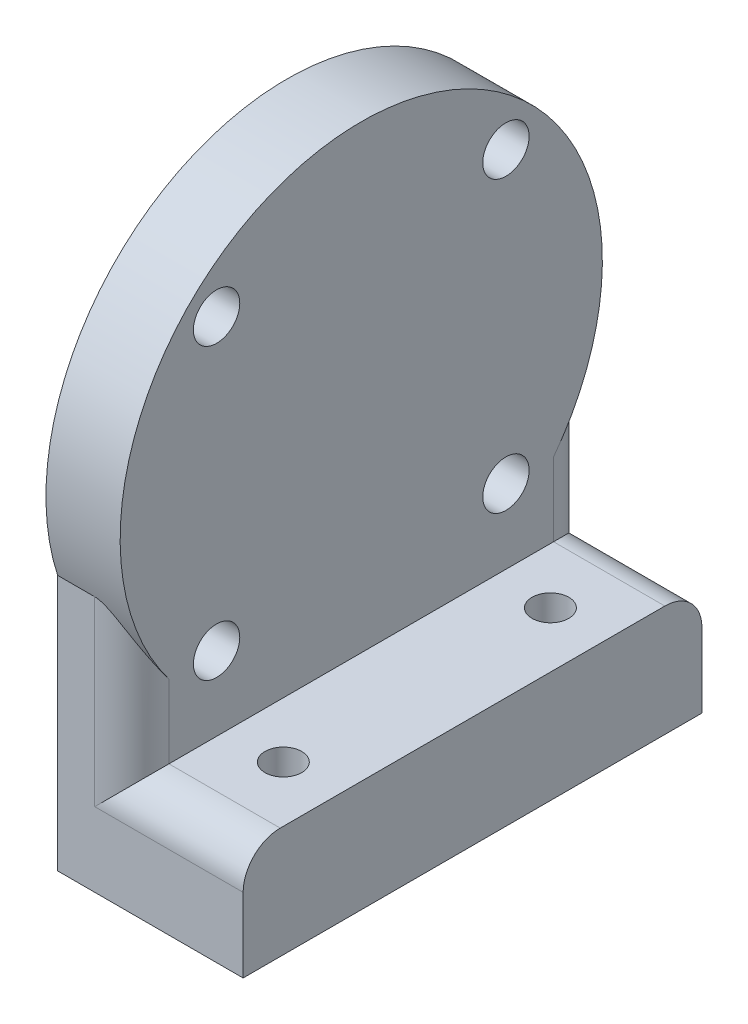
ISO-10303-21;
HEADER;
FILE_DESCRIPTION(('STEP AP214'),'2;1');
FILE_NAME('part.step','',(''),(''),'','','');
FILE_SCHEMA(('AUTOMOTIVE_DESIGN { 1 0 10303 214 1 1 1 1 }'));
ENDSEC;
DATA;
#1=APPLICATION_CONTEXT('core data for automotive mechanical design processes');
#2=APPLICATION_PROTOCOL_DEFINITION('international standard','automotive_design',2000,#1);
#3=PRODUCT_CONTEXT('',#1,'mechanical');
#4=PRODUCT('Part','Part','',(#3));
#5=PRODUCT_RELATED_PRODUCT_CATEGORY('part','',(#4));
#6=PRODUCT_DEFINITION_FORMATION('','',#4);
#7=PRODUCT_DEFINITION_CONTEXT('part definition',#1,'design');
#8=PRODUCT_DEFINITION('design','',#6,#7);
#9=PRODUCT_DEFINITION_SHAPE('','',#8);
#10=(LENGTH_UNIT() NAMED_UNIT(*) SI_UNIT(.MILLI.,.METRE.));
#11=(NAMED_UNIT(*) PLANE_ANGLE_UNIT() SI_UNIT($,.RADIAN.));
#12=(NAMED_UNIT(*) SI_UNIT($,.STERADIAN.) SOLID_ANGLE_UNIT());
#13=UNCERTAINTY_MEASURE_WITH_UNIT(LENGTH_MEASURE(1.E-05),#10,'distance_accuracy_value','');
#14=(GEOMETRIC_REPRESENTATION_CONTEXT(3) GLOBAL_UNCERTAINTY_ASSIGNED_CONTEXT((#13)) GLOBAL_UNIT_ASSIGNED_CONTEXT((#10,
#11,#12)) REPRESENTATION_CONTEXT('',''));
#15=CARTESIAN_POINT('',(0.,0.,0.));
#16=DIRECTION('',(0.,0.,1.));
#17=DIRECTION('',(1.,0.,0.));
#18=AXIS2_PLACEMENT_3D('',#15,#16,#17);
#19=CARTESIAN_POINT('',(10.,0.,0.));
#20=DIRECTION('',(-1.,0.,0.));
#21=DIRECTION('',(0.,0.,1.));
#22=AXIS2_PLACEMENT_3D('',#19,#20,#21);
#23=CYLINDRICAL_SURFACE('',#22,32.5);
#24=CARTESIAN_POINT('',(10.,0.,0.));
#25=DIRECTION('',(1.,0.,0.));
#26=DIRECTION('',(0.,0.,-1.));
#27=AXIS2_PLACEMENT_3D('',#24,#25,#26);
#28=CIRCLE('',#27,32.5);
#29=CARTESIAN_POINT('',(10.,-19.6018601648243,-25.9232921921324));
#30=VERTEX_POINT('',#29);
#31=CARTESIAN_POINT('',(10.,-19.6018601648243,25.9232921921325));
#32=VERTEX_POINT('',#31);
#33=EDGE_CURVE('E131',#30,#32,#28,.T.);
#34=ORIENTED_EDGE('',*,*,#33,.F.);
#35=CARTESIAN_POINT('',(10.,-19.6018601648243,-25.9232921921325));
#36=CARTESIAN_POINT('',(9.99998785813294,-19.4446933962099,-26.0421383240384));
#37=CARTESIAN_POINT('',(9.99576308085677,-19.2864612415139,-26.1595341988052));
#38=CARTESIAN_POINT('',(9.97941358114551,-18.9681930478085,-26.3912167495624));
#39=CARTESIAN_POINT('',(9.96729073501091,-18.8081574461053,-26.5055041572981));
#40=CARTESIAN_POINT('',(9.93568153678088,-18.4866524819665,-26.7307349325186));
#41=CARTESIAN_POINT('',(9.91620060162878,-18.3251842593972,-26.8416806953652));
#42=CARTESIAN_POINT('',(9.87030994286588,-18.0009507578986,-27.0601923213267));
#43=CARTESIAN_POINT('',(9.84389973226215,-17.8381853885849,-27.1677579462888));
#44=CARTESIAN_POINT('',(9.75363592974372,-17.3415549424522,-27.4896001103524));
#45=CARTESIAN_POINT('',(9.6794237483802,-17.0059581978761,-27.6983977111794));
#46=CARTESIAN_POINT('',(9.50620989951119,-16.3322431150558,-28.1009242670519));
#47=CARTESIAN_POINT('',(9.40720706410947,-15.9941246587413,-28.2946525116112));
#48=CARTESIAN_POINT('',(9.17820527903657,-15.2941817824925,-28.6793989589671));
#49=CARTESIAN_POINT('',(9.04656244862404,-14.9323011639338,-28.8693470905034));
#50=CARTESIAN_POINT('',(8.82882960544987,-14.3907709578673,-29.1409788427625));
#51=CARTESIAN_POINT('',(8.75281545727215,-14.2103541113143,-29.229363099304));
#52=CARTESIAN_POINT('',(8.59375465446422,-13.8504582275516,-29.4016083312248));
#53=CARTESIAN_POINT('',(8.51070843259636,-13.6709791333522,-29.4854695844359));
#54=CARTESIAN_POINT('',(8.33798578145804,-13.3153065603456,-29.6477730810611));
#55=CARTESIAN_POINT('',(8.24838277688641,-13.1390981335559,-29.7262605925395));
#56=CARTESIAN_POINT('',(8.06110896617103,-12.7889698600797,-29.8785654715547));
#57=CARTESIAN_POINT('',(7.96343907795765,-12.6150497556089,-29.9523833687633));
#58=CARTESIAN_POINT('',(7.75909766661963,-12.2710033039346,-30.0949676409248));
#59=CARTESIAN_POINT('',(7.65244591686164,-12.1008696143258,-30.1637445195341));
#60=CARTESIAN_POINT('',(7.4282624495199,-11.7658471830656,-30.2959927394941));
#61=CARTESIAN_POINT('',(7.31073828529234,-11.6009549054901,-30.3594677067479));
#62=CARTESIAN_POINT('',(7.13598011446697,-11.3750335950163,-30.4444327188526));
#63=CARTESIAN_POINT('',(7.08444257619157,-11.3105385350068,-30.4684478265857));
#64=CARTESIAN_POINT('',(6.97885607849103,-11.1832420527845,-30.5154011408752));
#65=CARTESIAN_POINT('',(6.924807048535,-11.1204406782143,-30.5383393171514));
#66=CARTESIAN_POINT('',(6.75815611719442,-10.9347584590993,-30.6055275028806));
#67=CARTESIAN_POINT('',(6.64129657707948,-10.8149249091174,-30.6480291961218));
#68=CARTESIAN_POINT('',(6.45449376777346,-10.6443609124064,-30.7075122948644));
#69=CARTESIAN_POINT('',(6.38980937194668,-10.5886780085011,-30.72674856593));
#70=CARTESIAN_POINT('',(6.2563574555159,-10.48179902235,-30.7633725732251));
#71=CARTESIAN_POINT('',(6.18758841043837,-10.4306046331843,-30.7807596124417));
#72=CARTESIAN_POINT('',(5.97496951243204,-10.2861458006791,-30.8294558506852));
#73=CARTESIAN_POINT('',(5.82403814428358,-10.2012599197118,-30.8575580291418));
#74=CARTESIAN_POINT('',(5.5769578747899,-10.1003891744018,-30.8906719294122));
#75=CARTESIAN_POINT('',(5.48708593341021,-10.0706234612454,-30.9003732593906));
#76=CARTESIAN_POINT('',(5.30345832023253,-10.0258996193538,-30.9149141691966));
#77=CARTESIAN_POINT('',(5.20971631829817,-10.0108933584484,-30.919769552948));
#78=CARTESIAN_POINT('',(5.07700342923393,-10.0013593117558,-30.9228521641555));
#79=CARTESIAN_POINT('',(5.03849639769414,-9.99996573509313,-30.9233021704094));
#80=CARTESIAN_POINT('',(5.,-10.0000000000001,-30.9232921921324));
#81=B_SPLINE_CURVE_WITH_KNOTS('',3,(#35,#36,#37,#38,#39,#40,#41,#42,#43,#44,#45,#46,#47,#48,#49,
#50,#51,#52,#53,#54,#55,#56,#57,#58,#59,#60,#61,#62,#63,#64,#65,#66,#67,#68,#69,#70,#71,#72,#73,
#74,#75,#76,#77,#78,#79,#80),.UNSPECIFIED.,.F.,.F.,(4,2,2,2,2,2,2,2,2,2,2,2,2,2,2,2,2,2,2,2,2,2,
4),(0.,0.591038002917525,1.18193564738411,1.7723991247862,2.36290411137619,3.56811560129786,
4.77338387983301,6.06019419424251,6.70447369130864,7.34871356740912,7.9866030201678,
8.6244199872493,9.26086778901706,9.89687670721251,10.1547593329167,10.4126492051889,
10.9297035978319,11.1919561813796,11.4543072655177,11.9757309886765,12.2601824310296,
12.5437031399848,12.6592024651113),.UNSPECIFIED.);
#82=CARTESIAN_POINT('',(5.,-10.,-30.9232921921325));
#83=VERTEX_POINT('',#82);
#84=EDGE_CURVE('E42',#30,#83,#81,.T.);
#85=ORIENTED_EDGE('',*,*,#84,.T.);
#86=DIRECTION('',(-1.,0.,0.));
#87=VECTOR('',#86,1.);
#88=CARTESIAN_POINT('',(80.8184298046773,-10.,-30.9232921921325));
#89=LINE('',#88,#87);
#90=CARTESIAN_POINT('',(0.,-10.,-30.9232921921325));
#91=VERTEX_POINT('',#90);
#92=EDGE_CURVE('E118',#83,#91,#89,.T.);
#93=ORIENTED_EDGE('',*,*,#92,.T.);
#94=CARTESIAN_POINT('',(0.,0.,0.));
#95=DIRECTION('',(1.,0.,0.));
#96=DIRECTION('',(0.,0.,-1.));
#97=AXIS2_PLACEMENT_3D('',#94,#95,#96);
#98=CIRCLE('',#97,32.5);
#99=CARTESIAN_POINT('',(0.,-10.,30.9232921921325));
#100=VERTEX_POINT('',#99);
#101=EDGE_CURVE('E125',#91,#100,#98,.T.);
#102=ORIENTED_EDGE('',*,*,#101,.T.);
#103=DIRECTION('',(-1.,0.,0.));
#104=VECTOR('',#103,1.);
#105=CARTESIAN_POINT('',(80.8184298046773,-10.,30.9232921921325));
#106=LINE('',#105,#104);
#107=CARTESIAN_POINT('',(5.,-10.,30.9232921921325));
#108=VERTEX_POINT('',#107);
#109=EDGE_CURVE('E109',#108,#100,#106,.T.);
#110=ORIENTED_EDGE('',*,*,#109,.F.);
#111=CARTESIAN_POINT('',(5.,-10.,30.9232921921325));
#112=CARTESIAN_POINT('',(5.05243279865254,-9.99996472826525,30.9233022453066));
#113=CARTESIAN_POINT('',(5.10484230577684,-10.0025492211647,30.9224678090984));
#114=CARTESIAN_POINT('',(5.20903070353185,-10.0126803462576,30.9191895538381));
#115=CARTESIAN_POINT('',(5.26081061215415,-10.0202174368638,30.9167488294185));
#116=CARTESIAN_POINT('',(5.36252242651876,-10.0398167285245,30.9103894659815));
#117=CARTESIAN_POINT('',(5.41247070564672,-10.0518029145889,30.9064956480947));
#118=CARTESIAN_POINT('',(5.51108096078863,-10.0798800839116,30.8973500224581));
#119=CARTESIAN_POINT('',(5.55974225686286,-10.0959731909494,30.8920975120792));
#120=CARTESIAN_POINT('',(5.73183208206213,-10.160326014987,30.8710243146895));
#121=CARTESIAN_POINT('',(5.85099118265557,-10.219015053902,30.8516889751184));
#122=CARTESIAN_POINT('',(6.0788056190665,-10.3531885937044,30.8069230519787));
#123=CARTESIAN_POINT('',(6.18737614038127,-10.428794895745,30.7814481566773));
#124=CARTESIAN_POINT('',(6.3903826324603,-10.5875817273045,30.7271847661825));
#125=CARTESIAN_POINT('',(6.48521548851953,-10.6703249461695,30.6985748236749));
#126=CARTESIAN_POINT('',(6.66728360567938,-10.8427584009582,30.6380964662237));
#127=CARTESIAN_POINT('',(6.75451129052188,-10.9324553999526,30.6062248691886));
#128=CARTESIAN_POINT('',(6.92267021031267,-11.1168509081429,30.5397324083395));
#129=CARTESIAN_POINT('',(7.00359052583381,-11.2115576345868,30.5051069775538));
#130=CARTESIAN_POINT('',(7.15992603416836,-11.4044647879071,30.4335140258417));
#131=CARTESIAN_POINT('',(7.23534321064783,-11.5026639367271,30.3965473579047));
#132=CARTESIAN_POINT('',(7.41466068213455,-11.7468603160495,30.3032215255993));
#133=CARTESIAN_POINT('',(7.51594931294703,-11.8943192044044,30.2456769918685));
#134=CARTESIAN_POINT('',(7.71032924991943,-12.192985353848,30.1265166004586));
#135=CARTESIAN_POINT('',(7.80341722942097,-12.3441941045134,30.0648991081312));
#136=CARTESIAN_POINT('',(7.9826142844992,-12.6493812203704,29.9377774366107));
#137=CARTESIAN_POINT('',(8.06871394684459,-12.8033629907389,29.8722682143145));
#138=CARTESIAN_POINT('',(8.23458870960407,-13.1131404133422,29.7375871060325));
#139=CARTESIAN_POINT('',(8.31436287164873,-13.2689363307835,29.6684146791502));
#140=CARTESIAN_POINT('',(8.46834722660006,-13.5822678156436,29.5262880921394));
#141=CARTESIAN_POINT('',(8.5425387821932,-13.7398073565132,29.4533225301474));
#142=CARTESIAN_POINT('',(8.68541911572378,-14.0557194131722,29.303878659147));
#143=CARTESIAN_POINT('',(8.75410743703855,-14.2140919969227,29.2274000594761));
#144=CARTESIAN_POINT('',(8.95216309243327,-14.6897304869866,28.9928725265024));
#145=CARTESIAN_POINT('',(9.07363934576333,-15.007760416927,28.8296218477662));
#146=CARTESIAN_POINT('',(9.31238922513554,-15.6905952936429,28.464477313778));
#147=CARTESIAN_POINT('',(9.42640615934749,-16.0553875370973,28.2604338745715));
#148=CARTESIAN_POINT('',(9.62617925371721,-16.7825330663001,27.834761734846));
#149=CARTESIAN_POINT('',(9.71193734421034,-17.1448865169831,27.6131342367616));
#150=CARTESIAN_POINT('',(9.81685888815131,-17.6826239835708,27.2693862990727));
#151=CARTESIAN_POINT('',(9.84776496938505,-17.8598648254158,27.1536419796727));
#152=CARTESIAN_POINT('',(9.9015191933038,-18.2128882147727,26.9181296586314));
#153=CARTESIAN_POINT('',(9.92436800023443,-18.38867088133,26.798361989569));
#154=CARTESIAN_POINT('',(9.96148471900396,-18.7386122045262,26.5548464487188));
#155=CARTESIAN_POINT('',(9.97574524317821,-18.912769336475,26.4310952463917));
#156=CARTESIAN_POINT('',(9.9949957753718,-19.258989986863,26.1798997091904));
#157=CARTESIAN_POINT('',(9.99998311066371,-19.4310528875095,26.0524543203198));
#158=CARTESIAN_POINT('',(10.,-19.6018601648243,25.9232921921325));
#159=B_SPLINE_CURVE_WITH_KNOTS('',3,(#111,#112,#113,#114,#115,#116,#117,#118,#119,#120,#121,
#122,#123,#124,#125,#126,#127,#128,#129,#130,#131,#132,#133,#134,#135,#136,#137,#138,#139,#140,
#141,#142,#143,#144,#145,#146,#147,#148,#149,#150,#151,#152,#153,#154,#155,#156,#157,#158),
.UNSPECIFIED.,.F.,.F.,(4,2,2,2,2,2,2,2,2,2,2,2,2,2,2,2,2,2,2,2,2,2,2,4),(0.,0.157190726868303,
0.31407949729913,0.468402656279282,0.622805781458559,1.02295811687609,1.42608988692812,
1.81270282228678,2.19969660207382,2.58734612129456,2.97485521062451,3.53827708275912,
4.10192646894037,4.6663229055475,5.23080291267597,5.79709071702267,6.36342545969977,
7.49522074332626,8.79378435174101,10.0922592380849,10.7338924227701,11.3754726985293,
12.0176040780555,12.659920504634),.UNSPECIFIED.);
#160=EDGE_CURVE('E11',#108,#32,#159,.T.);
#161=ORIENTED_EDGE('',*,*,#160,.T.);
#162=EDGE_LOOP('',(#34,#85,#93,#102,#110,#161));
#163=FACE_BOUND('',#162,.T.);
#164=ADVANCED_FACE('F33',(#163),#23,.T.);
#165=CARTESIAN_POINT('',(10.,0.,0.));
#166=DIRECTION('',(1.,0.,0.));
#167=DIRECTION('',(0.,0.,-1.));
#168=AXIS2_PLACEMENT_3D('',#165,#166,#167);
#169=PLANE('',#168);
#170=DIRECTION('',(0.,0.,1.));
#171=VECTOR('',#170,1.);
#172=CARTESIAN_POINT('',(10.,-29.5,30.9232921921325));
#173=LINE('',#172,#171);
#174=CARTESIAN_POINT('',(10.,-29.5,-25.9232921921325));
#175=VERTEX_POINT('',#174);
#176=CARTESIAN_POINT('',(10.,-29.5,25.9232921921325));
#177=VERTEX_POINT('',#176);
#178=EDGE_CURVE('E134',#175,#177,#173,.T.);
#179=ORIENTED_EDGE('',*,*,#178,.F.);
#180=DIRECTION('',(0.,-1.,0.));
#181=VECTOR('',#180,1.);
#182=CARTESIAN_POINT('',(10.,-10.,-25.9232921921324));
#183=LINE('',#182,#181);
#184=EDGE_CURVE('E148',#175,#30,#183,.F.);
#185=ORIENTED_EDGE('',*,*,#184,.T.);
#186=ORIENTED_EDGE('',*,*,#33,.T.);
#187=DIRECTION('',(0.,1.,0.));
#188=VECTOR('',#187,1.);
#189=CARTESIAN_POINT('',(10.,-29.5,25.9232921921325));
#190=LINE('',#189,#188);
#191=EDGE_CURVE('E146',#32,#177,#190,.F.);
#192=ORIENTED_EDGE('',*,*,#191,.T.);
#193=EDGE_LOOP('',(#179,#185,#186,#192));
#194=FACE_BOUND('',#193,.T.);
#195=CARTESIAN_POINT('',(10.,-19.502005025125,-19.502005025125));
#196=DIRECTION('',(1.,0.,0.));
#197=DIRECTION('',(0.,0.,-1.));
#198=AXIS2_PLACEMENT_3D('',#195,#196,#197);
#199=CIRCLE('',#198,3.125);
#200=CARTESIAN_POINT('',(10.,-19.502005025125,-22.6270050251249));
#201=VERTEX_POINT('',#200);
#202=EDGE_CURVE('E279',#201,#201,#199,.T.);
#203=ORIENTED_EDGE('',*,*,#202,.F.);
#204=EDGE_LOOP('',(#203));
#205=FACE_BOUND('',#204,.T.);
#206=CARTESIAN_POINT('',(10.,19.502005025125,-19.502005025125));
#207=DIRECTION('',(1.,0.,0.));
#208=DIRECTION('',(0.,0.,-1.));
#209=AXIS2_PLACEMENT_3D('',#206,#207,#208);
#210=CIRCLE('',#209,3.125);
#211=CARTESIAN_POINT('',(10.,19.502005025125,-22.627005025125));
#212=VERTEX_POINT('',#211);
#213=EDGE_CURVE('E289',#212,#212,#210,.T.);
#214=ORIENTED_EDGE('',*,*,#213,.F.);
#215=EDGE_LOOP('',(#214));
#216=FACE_BOUND('',#215,.T.);
#217=CARTESIAN_POINT('',(10.,19.502005025125,19.5020050251249));
#218=DIRECTION('',(1.,0.,0.));
#219=DIRECTION('',(0.,0.,-1.));
#220=AXIS2_PLACEMENT_3D('',#217,#218,#219);
#221=CIRCLE('',#220,3.125);
#222=CARTESIAN_POINT('',(10.,19.502005025125,16.3770050251249));
#223=VERTEX_POINT('',#222);
#224=EDGE_CURVE('E283',#223,#223,#221,.T.);
#225=ORIENTED_EDGE('',*,*,#224,.F.);
#226=EDGE_LOOP('',(#225));
#227=FACE_BOUND('',#226,.T.);
#228=CARTESIAN_POINT('',(10.,-19.5020050251249,19.502005025125));
#229=DIRECTION('',(1.,0.,0.));
#230=DIRECTION('',(0.,0.,-1.));
#231=AXIS2_PLACEMENT_3D('',#228,#229,#230);
#232=CIRCLE('',#231,3.125);
#233=CARTESIAN_POINT('',(10.,-19.5020050251249,16.377005025125));
#234=VERTEX_POINT('',#233);
#235=EDGE_CURVE('E137',#234,#234,#232,.T.);
#236=ORIENTED_EDGE('',*,*,#235,.F.);
#237=EDGE_LOOP('',(#236));
#238=FACE_BOUND('',#237,.T.);
#239=ADVANCED_FACE('F191',(#194,#205,#216,#227,#238),#169,.T.);
#240=CARTESIAN_POINT('',(0.,0.,0.));
#241=DIRECTION('',(1.,0.,0.));
#242=DIRECTION('',(0.,0.,-1.));
#243=AXIS2_PLACEMENT_3D('',#240,#241,#242);
#244=PLANE('',#243);
#245=CARTESIAN_POINT('',(0.,-19.502005025125,-19.502005025125));
#246=DIRECTION('',(1.,0.,0.));
#247=DIRECTION('',(0.,0.,-1.));
#248=AXIS2_PLACEMENT_3D('',#245,#246,#247);
#249=CIRCLE('',#248,3.125);
#250=CARTESIAN_POINT('',(0.,-19.502005025125,-22.6270050251249));
#251=VERTEX_POINT('',#250);
#252=EDGE_CURVE('E292',#251,#251,#249,.T.);
#253=ORIENTED_EDGE('',*,*,#252,.T.);
#254=EDGE_LOOP('',(#253));
#255=FACE_BOUND('',#254,.T.);
#256=CARTESIAN_POINT('',(0.,19.502005025125,-19.502005025125));
#257=DIRECTION('',(1.,0.,0.));
#258=DIRECTION('',(0.,0.,-1.));
#259=AXIS2_PLACEMENT_3D('',#256,#257,#258);
#260=CIRCLE('',#259,3.125);
#261=CARTESIAN_POINT('',(0.,19.502005025125,-22.627005025125));
#262=VERTEX_POINT('',#261);
#263=EDGE_CURVE('E286',#262,#262,#260,.T.);
#264=ORIENTED_EDGE('',*,*,#263,.T.);
#265=EDGE_LOOP('',(#264));
#266=FACE_BOUND('',#265,.T.);
#267=CARTESIAN_POINT('',(0.,19.502005025125,19.5020050251249));
#268=DIRECTION('',(1.,0.,0.));
#269=DIRECTION('',(0.,0.,-1.));
#270=AXIS2_PLACEMENT_3D('',#267,#268,#269);
#271=CIRCLE('',#270,3.125);
#272=CARTESIAN_POINT('',(0.,19.502005025125,16.3770050251249));
#273=VERTEX_POINT('',#272);
#274=EDGE_CURVE('E280',#273,#273,#271,.T.);
#275=ORIENTED_EDGE('',*,*,#274,.T.);
#276=EDGE_LOOP('',(#275));
#277=FACE_BOUND('',#276,.T.);
#278=CARTESIAN_POINT('',(0.,-19.5020050251249,19.502005025125));
#279=DIRECTION('',(1.,0.,0.));
#280=DIRECTION('',(0.,0.,-1.));
#281=AXIS2_PLACEMENT_3D('',#278,#279,#280);
#282=CIRCLE('',#281,3.125);
#283=CARTESIAN_POINT('',(0.,-19.5020050251249,16.377005025125));
#284=VERTEX_POINT('',#283);
#285=EDGE_CURVE('E132',#284,#284,#282,.T.);
#286=ORIENTED_EDGE('',*,*,#285,.T.);
#287=EDGE_LOOP('',(#286));
#288=FACE_BOUND('',#287,.T.);
#289=ORIENTED_EDGE('',*,*,#101,.F.);
#290=DIRECTION('',(0.,-1.,0.));
#291=VECTOR('',#290,1.);
#292=CARTESIAN_POINT('',(0.,-10.,-30.9232921921325));
#293=LINE('',#292,#291);
#294=CARTESIAN_POINT('',(0.,-44.5,-30.9232921921325));
#295=VERTEX_POINT('',#294);
#296=EDGE_CURVE('E254',#91,#295,#293,.T.);
#297=ORIENTED_EDGE('',*,*,#296,.T.);
#298=DIRECTION('',(0.,0.,1.));
#299=VECTOR('',#298,1.);
#300=CARTESIAN_POINT('',(0.,-44.5,-30.9232921921325));
#301=LINE('',#300,#299);
#302=CARTESIAN_POINT('',(0.,-44.5,30.9232921921325));
#303=VERTEX_POINT('',#302);
#304=EDGE_CURVE('E127',#295,#303,#301,.T.);
#305=ORIENTED_EDGE('',*,*,#304,.T.);
#306=DIRECTION('',(0.,1.,0.));
#307=VECTOR('',#306,1.);
#308=CARTESIAN_POINT('',(0.,-44.5,30.9232921921325));
#309=LINE('',#308,#307);
#310=EDGE_CURVE('E113',#303,#100,#309,.T.);
#311=ORIENTED_EDGE('',*,*,#310,.T.);
#312=EDGE_LOOP('',(#289,#297,#305,#311));
#313=FACE_BOUND('',#312,.T.);
#314=ADVANCED_FACE('F123',(#255,#266,#277,#288,#313),#244,.F.);
#315=CARTESIAN_POINT('',(0.,-19.5020050251249,19.502005025125));
#316=DIRECTION('',(1.,0.,0.));
#317=DIRECTION('',(0.,0.,-1.));
#318=AXIS2_PLACEMENT_3D('',#315,#316,#317);
#319=CYLINDRICAL_SURFACE('',#318,3.125);
#320=ORIENTED_EDGE('',*,*,#285,.F.);
#321=EDGE_LOOP('',(#320));
#322=FACE_BOUND('',#321,.T.);
#323=ORIENTED_EDGE('',*,*,#235,.T.);
#324=EDGE_LOOP('',(#323));
#325=FACE_BOUND('',#324,.T.);
#326=ADVANCED_FACE('F200',(#322,#325),#319,.F.);
#327=CARTESIAN_POINT('',(0.,19.502005025125,19.5020050251249));
#328=DIRECTION('',(1.,0.,0.));
#329=DIRECTION('',(0.,0.,-1.));
#330=AXIS2_PLACEMENT_3D('',#327,#328,#329);
#331=CYLINDRICAL_SURFACE('',#330,3.125);
#332=ORIENTED_EDGE('',*,*,#274,.F.);
#333=EDGE_LOOP('',(#332));
#334=FACE_BOUND('',#333,.T.);
#335=ORIENTED_EDGE('',*,*,#224,.T.);
#336=EDGE_LOOP('',(#335));
#337=FACE_BOUND('',#336,.T.);
#338=ADVANCED_FACE('F207',(#334,#337),#331,.F.);
#339=CARTESIAN_POINT('',(0.,19.502005025125,-19.502005025125));
#340=DIRECTION('',(1.,0.,0.));
#341=DIRECTION('',(0.,0.,-1.));
#342=AXIS2_PLACEMENT_3D('',#339,#340,#341);
#343=CYLINDRICAL_SURFACE('',#342,3.125);
#344=ORIENTED_EDGE('',*,*,#263,.F.);
#345=EDGE_LOOP('',(#344));
#346=FACE_BOUND('',#345,.T.);
#347=ORIENTED_EDGE('',*,*,#213,.T.);
#348=EDGE_LOOP('',(#347));
#349=FACE_BOUND('',#348,.T.);
#350=ADVANCED_FACE('F212',(#346,#349),#343,.F.);
#351=CARTESIAN_POINT('',(0.,-19.502005025125,-19.502005025125));
#352=DIRECTION('',(1.,0.,0.));
#353=DIRECTION('',(0.,0.,-1.));
#354=AXIS2_PLACEMENT_3D('',#351,#352,#353);
#355=CYLINDRICAL_SURFACE('',#354,3.125);
#356=ORIENTED_EDGE('',*,*,#252,.F.);
#357=EDGE_LOOP('',(#356));
#358=FACE_BOUND('',#357,.T.);
#359=ORIENTED_EDGE('',*,*,#202,.T.);
#360=EDGE_LOOP('',(#359));
#361=FACE_BOUND('',#360,.T.);
#362=ADVANCED_FACE('F209',(#358,#361),#355,.F.);
#363=CARTESIAN_POINT('',(25.,-44.5,30.9232921921325));
#364=DIRECTION('',(0.,0.,-1.));
#365=DIRECTION('',(-1.,0.,0.));
#366=AXIS2_PLACEMENT_3D('',#363,#364,#365);
#367=PLANE('',#366);
#368=DIRECTION('',(-1.,0.,0.));
#369=VECTOR('',#368,1.);
#370=CARTESIAN_POINT('',(25.,-34.5,30.9232921921325));
#371=LINE('',#370,#369);
#372=CARTESIAN_POINT('',(25.,-34.5,30.9232921921325));
#373=VERTEX_POINT('',#372);
#374=CARTESIAN_POINT('',(5.,-34.5,30.9232921921325));
#375=VERTEX_POINT('',#374);
#376=EDGE_CURVE('E151',#373,#375,#371,.T.);
#377=ORIENTED_EDGE('',*,*,#376,.T.);
#378=DIRECTION('',(0.,1.,0.));
#379=VECTOR('',#378,1.);
#380=CARTESIAN_POINT('',(5.,-10.,30.9232921921325));
#381=LINE('',#380,#379);
#382=EDGE_CURVE('E115',#375,#108,#381,.T.);
#383=ORIENTED_EDGE('',*,*,#382,.T.);
#384=ORIENTED_EDGE('',*,*,#109,.T.);
#385=ORIENTED_EDGE('',*,*,#310,.F.);
#386=DIRECTION('',(-1.,0.,0.));
#387=VECTOR('',#386,1.);
#388=CARTESIAN_POINT('',(25.,-44.5,30.9232921921325));
#389=LINE('',#388,#387);
#390=CARTESIAN_POINT('',(25.,-44.5,30.9232921921325));
#391=VERTEX_POINT('',#390);
#392=EDGE_CURVE('E277',#391,#303,#389,.T.);
#393=ORIENTED_EDGE('',*,*,#392,.F.);
#394=DIRECTION('',(0.,-1.,0.));
#395=VECTOR('',#394,1.);
#396=CARTESIAN_POINT('',(25.,-44.5,30.9232921921325));
#397=LINE('',#396,#395);
#398=EDGE_CURVE('E266',#373,#391,#397,.T.);
#399=ORIENTED_EDGE('',*,*,#398,.F.);
#400=EDGE_LOOP('',(#377,#383,#384,#385,#393,#399));
#401=FACE_BOUND('',#400,.T.);
#402=ADVANCED_FACE('F111',(#401),#367,.F.);
#403=CARTESIAN_POINT('',(25.,-44.5,30.9232921921325));
#404=DIRECTION('',(0.,1.,0.));
#405=DIRECTION('',(0.,0.,1.));
#406=AXIS2_PLACEMENT_3D('',#403,#404,#405);
#407=PLANE('',#406);
#408=CARTESIAN_POINT('',(17.5,-44.5,18.));
#409=DIRECTION('',(0.,1.,0.));
#410=DIRECTION('',(0.,0.,1.));
#411=AXIS2_PLACEMENT_3D('',#408,#409,#410);
#412=CIRCLE('',#411,2.475);
#413=CARTESIAN_POINT('',(17.5,-44.5,20.475));
#414=VERTEX_POINT('',#413);
#415=EDGE_CURVE('E248',#414,#414,#412,.T.);
#416=ORIENTED_EDGE('',*,*,#415,.T.);
#417=EDGE_LOOP('',(#416));
#418=FACE_BOUND('',#417,.T.);
#419=CARTESIAN_POINT('',(17.5,-44.5,-18.));
#420=DIRECTION('',(0.,1.,0.));
#421=DIRECTION('',(0.,0.,-1.));
#422=AXIS2_PLACEMENT_3D('',#419,#420,#421);
#423=CIRCLE('',#422,2.475);
#424=CARTESIAN_POINT('',(17.5,-44.5,-20.475));
#425=VERTEX_POINT('',#424);
#426=EDGE_CURVE('E252',#425,#425,#423,.T.);
#427=ORIENTED_EDGE('',*,*,#426,.T.);
#428=EDGE_LOOP('',(#427));
#429=FACE_BOUND('',#428,.T.);
#430=ORIENTED_EDGE('',*,*,#392,.T.);
#431=ORIENTED_EDGE('',*,*,#304,.F.);
#432=DIRECTION('',(-1.,0.,0.));
#433=VECTOR('',#432,1.);
#434=CARTESIAN_POINT('',(25.,-44.5,-30.9232921921325));
#435=LINE('',#434,#433);
#436=CARTESIAN_POINT('',(25.,-44.5,-30.9232921921325));
#437=VERTEX_POINT('',#436);
#438=EDGE_CURVE('E274',#437,#295,#435,.T.);
#439=ORIENTED_EDGE('',*,*,#438,.F.);
#440=DIRECTION('',(0.,0.,-1.));
#441=VECTOR('',#440,1.);
#442=CARTESIAN_POINT('',(25.,-44.5,30.9232921921325));
#443=LINE('',#442,#441);
#444=EDGE_CURVE('E268',#391,#437,#443,.T.);
#445=ORIENTED_EDGE('',*,*,#444,.F.);
#446=EDGE_LOOP('',(#430,#431,#439,#445));
#447=FACE_BOUND('',#446,.T.);
#448=ADVANCED_FACE('F222',(#418,#429,#447),#407,.F.);
#449=CARTESIAN_POINT('',(25.,-44.5,-30.9232921921325));
#450=DIRECTION('',(0.,0.,1.));
#451=DIRECTION('',(0.,-1.,0.));
#452=AXIS2_PLACEMENT_3D('',#449,#450,#451);
#453=PLANE('',#452);
#454=ORIENTED_EDGE('',*,*,#92,.F.);
#455=DIRECTION('',(0.,-1.,0.));
#456=VECTOR('',#455,1.);
#457=CARTESIAN_POINT('',(5.,-29.5,-30.9232921921325));
#458=LINE('',#457,#456);
#459=CARTESIAN_POINT('',(5.,-34.5,-30.9232921921325));
#460=VERTEX_POINT('',#459);
#461=EDGE_CURVE('E143',#83,#460,#458,.T.);
#462=ORIENTED_EDGE('',*,*,#461,.T.);
#463=DIRECTION('',(-1.,0.,0.));
#464=VECTOR('',#463,1.);
#465=CARTESIAN_POINT('',(25.,-34.5,-30.9232921921325));
#466=LINE('',#465,#464);
#467=CARTESIAN_POINT('',(25.,-34.5,-30.9232921921325));
#468=VERTEX_POINT('',#467);
#469=EDGE_CURVE('E141',#460,#468,#466,.F.);
#470=ORIENTED_EDGE('',*,*,#469,.T.);
#471=DIRECTION('',(0.,1.,0.));
#472=VECTOR('',#471,1.);
#473=CARTESIAN_POINT('',(25.,-44.5,-30.9232921921325));
#474=LINE('',#473,#472);
#475=EDGE_CURVE('E270',#437,#468,#474,.T.);
#476=ORIENTED_EDGE('',*,*,#475,.F.);
#477=ORIENTED_EDGE('',*,*,#438,.T.);
#478=ORIENTED_EDGE('',*,*,#296,.F.);
#479=EDGE_LOOP('',(#454,#462,#470,#476,#477,#478));
#480=FACE_BOUND('',#479,.T.);
#481=ADVANCED_FACE('F225',(#480),#453,.F.);
#482=CARTESIAN_POINT('',(25.,-29.5,30.9232921921325));
#483=DIRECTION('',(0.,-1.,0.));
#484=DIRECTION('',(0.,0.,-1.));
#485=AXIS2_PLACEMENT_3D('',#482,#483,#484);
#486=PLANE('',#485);
#487=CARTESIAN_POINT('',(17.5,-29.5,18.));
#488=DIRECTION('',(0.,1.,0.));
#489=DIRECTION('',(0.,0.,1.));
#490=AXIS2_PLACEMENT_3D('',#487,#488,#489);
#491=CIRCLE('',#490,2.475);
#492=CARTESIAN_POINT('',(17.5,-29.5,20.475));
#493=VERTEX_POINT('',#492);
#494=EDGE_CURVE('E251',#493,#493,#491,.T.);
#495=ORIENTED_EDGE('',*,*,#494,.F.);
#496=EDGE_LOOP('',(#495));
#497=FACE_BOUND('',#496,.T.);
#498=CARTESIAN_POINT('',(17.5,-29.5,-18.));
#499=DIRECTION('',(0.,1.,0.));
#500=DIRECTION('',(0.,0.,-1.));
#501=AXIS2_PLACEMENT_3D('',#498,#499,#500);
#502=CIRCLE('',#501,2.475);
#503=CARTESIAN_POINT('',(17.5,-29.5,-20.475));
#504=VERTEX_POINT('',#503);
#505=EDGE_CURVE('E257',#504,#504,#502,.T.);
#506=ORIENTED_EDGE('',*,*,#505,.F.);
#507=EDGE_LOOP('',(#506));
#508=FACE_BOUND('',#507,.T.);
#509=DIRECTION('',(0.,0.,1.));
#510=VECTOR('',#509,1.);
#511=CARTESIAN_POINT('',(25.,-29.5,30.9232921921325));
#512=LINE('',#511,#510);
#513=CARTESIAN_POINT('',(25.,-29.5,-25.9232921921325));
#514=VERTEX_POINT('',#513);
#515=CARTESIAN_POINT('',(25.,-29.5,25.9232921921325));
#516=VERTEX_POINT('',#515);
#517=EDGE_CURVE('E272',#514,#516,#512,.T.);
#518=ORIENTED_EDGE('',*,*,#517,.F.);
#519=DIRECTION('',(-1.,0.,0.));
#520=VECTOR('',#519,1.);
#521=CARTESIAN_POINT('',(25.,-29.5,-25.9232921921325));
#522=LINE('',#521,#520);
#523=EDGE_CURVE('E155',#514,#175,#522,.T.);
#524=ORIENTED_EDGE('',*,*,#523,.T.);
#525=ORIENTED_EDGE('',*,*,#178,.T.);
#526=DIRECTION('',(-1.,0.,0.));
#527=VECTOR('',#526,1.);
#528=CARTESIAN_POINT('',(25.,-29.5,25.9232921921325));
#529=LINE('',#528,#527);
#530=EDGE_CURVE('E50',#177,#516,#529,.F.);
#531=ORIENTED_EDGE('',*,*,#530,.T.);
#532=EDGE_LOOP('',(#518,#524,#525,#531));
#533=FACE_BOUND('',#532,.T.);
#534=ADVANCED_FACE('F229',(#497,#508,#533),#486,.F.);
#535=CARTESIAN_POINT('',(25.,0.,0.));
#536=DIRECTION('',(-1.,0.,0.));
#537=DIRECTION('',(0.,0.,1.));
#538=AXIS2_PLACEMENT_3D('',#535,#536,#537);
#539=PLANE('',#538);
#540=ORIENTED_EDGE('',*,*,#475,.T.);
#541=CARTESIAN_POINT('',(25.,-34.5,-25.9232921921325));
#542=DIRECTION('',(-1.,0.,0.));
#543=DIRECTION('',(0.,0.,1.));
#544=AXIS2_PLACEMENT_3D('',#541,#542,#543);
#545=CIRCLE('',#544,5.);
#546=EDGE_CURVE('E57',#468,#514,#545,.F.);
#547=ORIENTED_EDGE('',*,*,#546,.T.);
#548=ORIENTED_EDGE('',*,*,#517,.T.);
#549=CARTESIAN_POINT('',(25.,-34.5,25.9232921921325));
#550=DIRECTION('',(-1.,0.,0.));
#551=DIRECTION('',(0.,0.,1.));
#552=AXIS2_PLACEMENT_3D('',#549,#550,#551);
#553=CIRCLE('',#552,5.);
#554=EDGE_CURVE('E157',#516,#373,#553,.F.);
#555=ORIENTED_EDGE('',*,*,#554,.T.);
#556=ORIENTED_EDGE('',*,*,#398,.T.);
#557=ORIENTED_EDGE('',*,*,#444,.T.);
#558=EDGE_LOOP('',(#540,#547,#548,#555,#556,#557));
#559=FACE_BOUND('',#558,.T.);
#560=ADVANCED_FACE('F233',(#559),#539,.F.);
#561=CARTESIAN_POINT('',(17.5,-44.5,-18.));
#562=DIRECTION('',(0.,1.,0.));
#563=DIRECTION('',(0.,0.,1.));
#564=AXIS2_PLACEMENT_3D('',#561,#562,#563);
#565=CYLINDRICAL_SURFACE('',#564,2.475);
#566=ORIENTED_EDGE('',*,*,#426,.F.);
#567=EDGE_LOOP('',(#566));
#568=FACE_BOUND('',#567,.T.);
#569=ORIENTED_EDGE('',*,*,#505,.T.);
#570=EDGE_LOOP('',(#569));
#571=FACE_BOUND('',#570,.T.);
#572=ADVANCED_FACE('F237',(#568,#571),#565,.F.);
#573=CARTESIAN_POINT('',(17.5,-44.5,18.));
#574=DIRECTION('',(0.,1.,0.));
#575=DIRECTION('',(0.,0.,1.));
#576=AXIS2_PLACEMENT_3D('',#573,#574,#575);
#577=CYLINDRICAL_SURFACE('',#576,2.475);
#578=ORIENTED_EDGE('',*,*,#415,.F.);
#579=EDGE_LOOP('',(#578));
#580=FACE_BOUND('',#579,.T.);
#581=ORIENTED_EDGE('',*,*,#494,.T.);
#582=EDGE_LOOP('',(#581));
#583=FACE_BOUND('',#582,.T.);
#584=ADVANCED_FACE('F179',(#580,#583),#577,.F.);
#585=CARTESIAN_POINT('',(25.,-34.5,-25.9232921921325));
#586=DIRECTION('',(-1.,0.,0.));
#587=DIRECTION('',(0.,0.,1.));
#588=AXIS2_PLACEMENT_3D('',#585,#586,#587);
#589=CYLINDRICAL_SURFACE('',#588,5.);
#590=ORIENTED_EDGE('',*,*,#546,.F.);
#591=ORIENTED_EDGE('',*,*,#469,.F.);
#592=CARTESIAN_POINT('',(5.,-34.5,-25.9232921921325));
#593=DIRECTION('',(-0.707106781186547,0.707106781186547,0.));
#594=DIRECTION('',(0.707106781186547,0.707106781186547,0.));
#595=AXIS2_PLACEMENT_3D('',#592,#593,#594);
#596=ELLIPSE('',#595,7.07106781186547,5.);
#597=EDGE_CURVE('E261',#175,#460,#596,.T.);
#598=ORIENTED_EDGE('',*,*,#597,.F.);
#599=ORIENTED_EDGE('',*,*,#523,.F.);
#600=EDGE_LOOP('',(#590,#591,#598,#599));
#601=FACE_BOUND('',#600,.T.);
#602=ADVANCED_FACE('F176',(#601),#589,.T.);
#603=CARTESIAN_POINT('',(5.,-44.5,-25.9232921921325));
#604=DIRECTION('',(0.,1.,0.));
#605=DIRECTION('',(0.,0.,1.));
#606=AXIS2_PLACEMENT_3D('',#603,#604,#605);
#607=CYLINDRICAL_SURFACE('',#606,5.);
#608=ORIENTED_EDGE('',*,*,#84,.F.);
#609=ORIENTED_EDGE('',*,*,#184,.F.);
#610=ORIENTED_EDGE('',*,*,#597,.T.);
#611=ORIENTED_EDGE('',*,*,#461,.F.);
#612=EDGE_LOOP('',(#608,#609,#610,#611));
#613=FACE_BOUND('',#612,.T.);
#614=ADVANCED_FACE('F172',(#613),#607,.T.);
#615=CARTESIAN_POINT('',(25.,-34.5,25.9232921921325));
#616=DIRECTION('',(-1.,0.,0.));
#617=DIRECTION('',(0.,0.,1.));
#618=AXIS2_PLACEMENT_3D('',#615,#616,#617);
#619=CYLINDRICAL_SURFACE('',#618,5.);
#620=ORIENTED_EDGE('',*,*,#554,.F.);
#621=ORIENTED_EDGE('',*,*,#530,.F.);
#622=CARTESIAN_POINT('',(5.,-34.5,25.9232921921325));
#623=DIRECTION('',(0.707106781186547,-0.707106781186547,0.));
#624=DIRECTION('',(-0.707106781186547,-0.707106781186547,0.));
#625=AXIS2_PLACEMENT_3D('',#622,#623,#624);
#626=ELLIPSE('',#625,7.07106781186547,5.);
#627=EDGE_CURVE('E37',#375,#177,#626,.F.);
#628=ORIENTED_EDGE('',*,*,#627,.F.);
#629=ORIENTED_EDGE('',*,*,#376,.F.);
#630=EDGE_LOOP('',(#620,#621,#628,#629));
#631=FACE_BOUND('',#630,.T.);
#632=ADVANCED_FACE('F35',(#631),#619,.T.);
#633=CARTESIAN_POINT('',(5.,-44.5,25.9232921921325));
#634=DIRECTION('',(0.,-1.,0.));
#635=DIRECTION('',(0.,0.,-1.));
#636=AXIS2_PLACEMENT_3D('',#633,#634,#635);
#637=CYLINDRICAL_SURFACE('',#636,5.);
#638=ORIENTED_EDGE('',*,*,#627,.T.);
#639=ORIENTED_EDGE('',*,*,#191,.F.);
#640=ORIENTED_EDGE('',*,*,#160,.F.);
#641=ORIENTED_EDGE('',*,*,#382,.F.);
#642=EDGE_LOOP('',(#638,#639,#640,#641));
#643=FACE_BOUND('',#642,.T.);
#644=ADVANCED_FACE('F181',(#643),#637,.T.);
#645=CLOSED_SHELL('',(#164,#239,#314,#326,#338,#350,#362,#402,#448,#481,#534,#560,#572,#584,
#602,#614,#632,#644));
#646=MANIFOLD_SOLID_BREP('B2',#645);
#647=ADVANCED_BREP_SHAPE_REPRESENTATION('',(#18,#646),#14);
#648=SHAPE_DEFINITION_REPRESENTATION(#9,#647);
ENDSEC;
END-ISO-10303-21;
